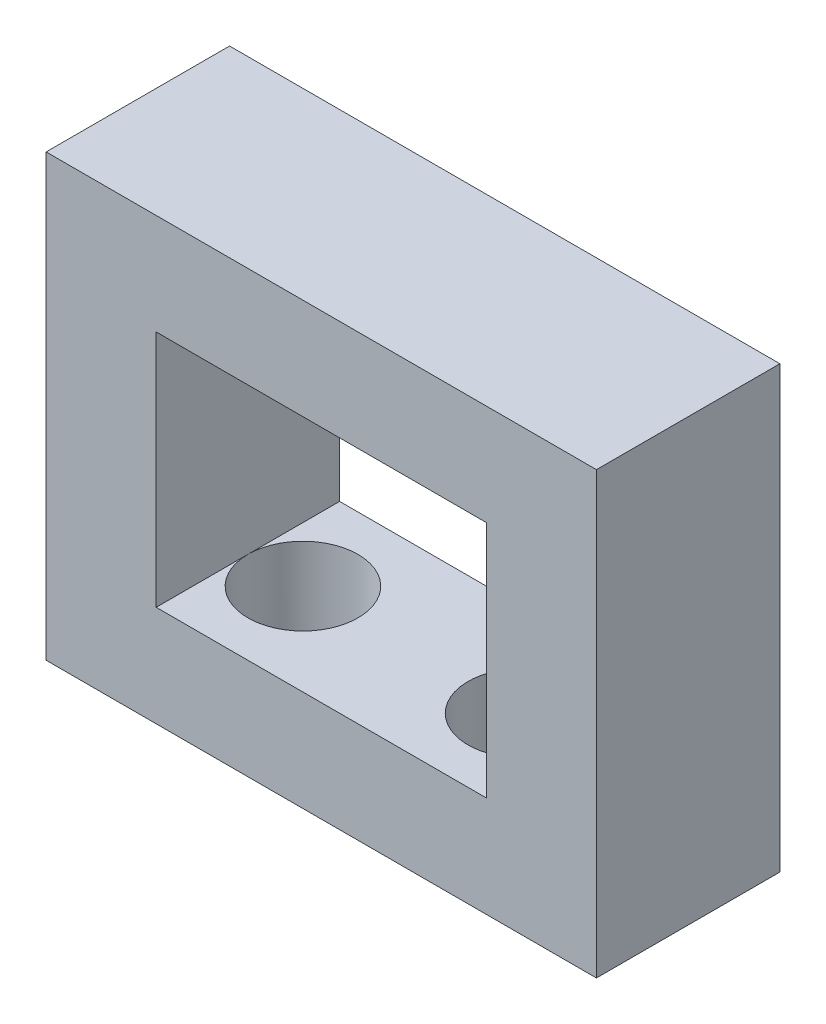
ISO-10303-21;
HEADER;
FILE_DESCRIPTION(('STEP AP214'),'2;1');
FILE_NAME('part.step','',(''),(''),'','','');
FILE_SCHEMA(('AUTOMOTIVE_DESIGN { 1 0 10303 214 1 1 1 1 }'));
ENDSEC;
DATA;
#1=APPLICATION_CONTEXT('core data for automotive mechanical design processes');
#2=APPLICATION_PROTOCOL_DEFINITION('international standard','automotive_design',2000,#1);
#3=PRODUCT_CONTEXT('',#1,'mechanical');
#4=PRODUCT('Part','Part','',(#3));
#5=PRODUCT_RELATED_PRODUCT_CATEGORY('part','',(#4));
#6=PRODUCT_DEFINITION_FORMATION('','',#4);
#7=PRODUCT_DEFINITION_CONTEXT('part definition',#1,'design');
#8=PRODUCT_DEFINITION('design','',#6,#7);
#9=PRODUCT_DEFINITION_SHAPE('','',#8);
#10=(LENGTH_UNIT() NAMED_UNIT(*) SI_UNIT(.MILLI.,.METRE.));
#11=(NAMED_UNIT(*) PLANE_ANGLE_UNIT() SI_UNIT($,.RADIAN.));
#12=(NAMED_UNIT(*) SI_UNIT($,.STERADIAN.) SOLID_ANGLE_UNIT());
#13=UNCERTAINTY_MEASURE_WITH_UNIT(LENGTH_MEASURE(1.E-05),#10,'distance_accuracy_value','');
#14=(GEOMETRIC_REPRESENTATION_CONTEXT(3) GLOBAL_UNCERTAINTY_ASSIGNED_CONTEXT((#13)) GLOBAL_UNIT_ASSIGNED_CONTEXT((#10,
#11,#12)) REPRESENTATION_CONTEXT('',''));
#15=CARTESIAN_POINT('',(0.,0.,0.));
#16=DIRECTION('',(0.,0.,1.));
#17=DIRECTION('',(1.,0.,0.));
#18=AXIS2_PLACEMENT_3D('',#15,#16,#17);
#19=CARTESIAN_POINT('',(7.5,-6.,2.5));
#20=DIRECTION('',(-1.,0.,0.));
#21=DIRECTION('',(0.,0.,1.));
#22=AXIS2_PLACEMENT_3D('',#19,#20,#21);
#23=PLANE('',#22);
#24=DIRECTION('',(0.,1.,0.));
#25=VECTOR('',#24,1.);
#26=CARTESIAN_POINT('',(7.5,-6.,-2.5));
#27=LINE('',#26,#25);
#28=CARTESIAN_POINT('',(7.5,-6.,-2.5));
#29=VERTEX_POINT('',#28);
#30=CARTESIAN_POINT('',(7.5,6.,-2.5));
#31=VERTEX_POINT('',#30);
#32=EDGE_CURVE('E146',#29,#31,#27,.T.);
#33=ORIENTED_EDGE('',*,*,#32,.T.);
#34=DIRECTION('',(0.,0.,-1.));
#35=VECTOR('',#34,1.);
#36=CARTESIAN_POINT('',(7.5,6.,2.5));
#37=LINE('',#36,#35);
#38=CARTESIAN_POINT('',(7.5,6.,2.5));
#39=VERTEX_POINT('',#38);
#40=EDGE_CURVE('E11',#39,#31,#37,.T.);
#41=ORIENTED_EDGE('',*,*,#40,.F.);
#42=DIRECTION('',(0.,1.,0.));
#43=VECTOR('',#42,1.);
#44=CARTESIAN_POINT('',(7.5,-6.,2.5));
#45=LINE('',#44,#43);
#46=CARTESIAN_POINT('',(7.5,-6.,2.5));
#47=VERTEX_POINT('',#46);
#48=EDGE_CURVE('E153',#47,#39,#45,.T.);
#49=ORIENTED_EDGE('',*,*,#48,.F.);
#50=DIRECTION('',(0.,0.,-1.));
#51=VECTOR('',#50,1.);
#52=CARTESIAN_POINT('',(7.5,-6.,2.5));
#53=LINE('',#52,#51);
#54=EDGE_CURVE('E163',#47,#29,#53,.T.);
#55=ORIENTED_EDGE('',*,*,#54,.T.);
#56=EDGE_LOOP('',(#33,#41,#49,#55));
#57=FACE_BOUND('',#56,.T.);
#58=ADVANCED_FACE('F35',(#57),#23,.F.);
#59=CARTESIAN_POINT('',(-7.5,6.,2.5));
#60=DIRECTION('',(0.,-1.,0.));
#61=DIRECTION('',(0.,0.,-1.));
#62=AXIS2_PLACEMENT_3D('',#59,#60,#61);
#63=PLANE('',#62);
#64=DIRECTION('',(-1.,0.,0.));
#65=VECTOR('',#64,1.);
#66=CARTESIAN_POINT('',(-7.5,6.,-2.5));
#67=LINE('',#66,#65);
#68=CARTESIAN_POINT('',(-7.5,6.,-2.5));
#69=VERTEX_POINT('',#68);
#70=EDGE_CURVE('E166',#31,#69,#67,.T.);
#71=ORIENTED_EDGE('',*,*,#70,.T.);
#72=DIRECTION('',(0.,0.,-1.));
#73=VECTOR('',#72,1.);
#74=CARTESIAN_POINT('',(-7.5,6.,2.5));
#75=LINE('',#74,#73);
#76=CARTESIAN_POINT('',(-7.5,6.,2.5));
#77=VERTEX_POINT('',#76);
#78=EDGE_CURVE('E42',#77,#69,#75,.T.);
#79=ORIENTED_EDGE('',*,*,#78,.F.);
#80=DIRECTION('',(-1.,0.,0.));
#81=VECTOR('',#80,1.);
#82=CARTESIAN_POINT('',(-7.5,6.,2.5));
#83=LINE('',#82,#81);
#84=EDGE_CURVE('E156',#39,#77,#83,.T.);
#85=ORIENTED_EDGE('',*,*,#84,.F.);
#86=ORIENTED_EDGE('',*,*,#40,.T.);
#87=EDGE_LOOP('',(#71,#79,#85,#86));
#88=FACE_BOUND('',#87,.T.);
#89=ADVANCED_FACE('F194',(#88),#63,.F.);
#90=CARTESIAN_POINT('',(-7.5,-6.,2.5));
#91=DIRECTION('',(1.,0.,0.));
#92=DIRECTION('',(0.,0.,-1.));
#93=AXIS2_PLACEMENT_3D('',#90,#91,#92);
#94=PLANE('',#93);
#95=DIRECTION('',(0.,-1.,0.));
#96=VECTOR('',#95,1.);
#97=CARTESIAN_POINT('',(-7.5,-6.,-2.5));
#98=LINE('',#97,#96);
#99=CARTESIAN_POINT('',(-7.5,-6.,-2.5));
#100=VERTEX_POINT('',#99);
#101=EDGE_CURVE('E168',#69,#100,#98,.T.);
#102=ORIENTED_EDGE('',*,*,#101,.T.);
#103=DIRECTION('',(0.,0.,-1.));
#104=VECTOR('',#103,1.);
#105=CARTESIAN_POINT('',(-7.5,-6.,2.5));
#106=LINE('',#105,#104);
#107=CARTESIAN_POINT('',(-7.5,-6.,2.5));
#108=VERTEX_POINT('',#107);
#109=EDGE_CURVE('E173',#108,#100,#106,.T.);
#110=ORIENTED_EDGE('',*,*,#109,.F.);
#111=DIRECTION('',(0.,-1.,0.));
#112=VECTOR('',#111,1.);
#113=CARTESIAN_POINT('',(-7.5,-6.,2.5));
#114=LINE('',#113,#112);
#115=EDGE_CURVE('E159',#77,#108,#114,.T.);
#116=ORIENTED_EDGE('',*,*,#115,.F.);
#117=ORIENTED_EDGE('',*,*,#78,.T.);
#118=EDGE_LOOP('',(#102,#110,#116,#117));
#119=FACE_BOUND('',#118,.T.);
#120=ADVANCED_FACE('F180',(#119),#94,.F.);
#121=CARTESIAN_POINT('',(-7.5,-6.,2.5));
#122=DIRECTION('',(0.,1.,0.));
#123=DIRECTION('',(0.,0.,1.));
#124=AXIS2_PLACEMENT_3D('',#121,#122,#123);
#125=PLANE('',#124);
#126=CARTESIAN_POINT('',(-3.,-6.,0.));
#127=DIRECTION('',(0.,-1.,0.));
#128=DIRECTION('',(0.,0.,-1.));
#129=AXIS2_PLACEMENT_3D('',#126,#127,#128);
#130=CIRCLE('',#129,1.5);
#131=CARTESIAN_POINT('',(-3.,-6.,-1.5));
#132=VERTEX_POINT('',#131);
#133=EDGE_CURVE('E233',#132,#132,#130,.T.);
#134=ORIENTED_EDGE('',*,*,#133,.F.);
#135=EDGE_LOOP('',(#134));
#136=FACE_BOUND('',#135,.T.);
#137=CARTESIAN_POINT('',(3.,-6.,0.));
#138=DIRECTION('',(0.,-1.,0.));
#139=DIRECTION('',(0.,0.,-1.));
#140=AXIS2_PLACEMENT_3D('',#137,#138,#139);
#141=CIRCLE('',#140,1.5);
#142=CARTESIAN_POINT('',(3.,-6.,-1.5));
#143=VERTEX_POINT('',#142);
#144=EDGE_CURVE('E236',#143,#143,#141,.T.);
#145=ORIENTED_EDGE('',*,*,#144,.F.);
#146=EDGE_LOOP('',(#145));
#147=FACE_BOUND('',#146,.T.);
#148=DIRECTION('',(1.,0.,0.));
#149=VECTOR('',#148,1.);
#150=CARTESIAN_POINT('',(-7.5,-6.,-2.5));
#151=LINE('',#150,#149);
#152=EDGE_CURVE('E157',#100,#29,#151,.T.);
#153=ORIENTED_EDGE('',*,*,#152,.T.);
#154=ORIENTED_EDGE('',*,*,#54,.F.);
#155=DIRECTION('',(1.,0.,0.));
#156=VECTOR('',#155,1.);
#157=CARTESIAN_POINT('',(-7.5,-6.,2.5));
#158=LINE('',#157,#156);
#159=EDGE_CURVE('E161',#108,#47,#158,.T.);
#160=ORIENTED_EDGE('',*,*,#159,.F.);
#161=ORIENTED_EDGE('',*,*,#109,.T.);
#162=EDGE_LOOP('',(#153,#154,#160,#161));
#163=FACE_BOUND('',#162,.T.);
#164=ADVANCED_FACE('F187',(#136,#147,#163),#125,.F.);
#165=CARTESIAN_POINT('',(0.,0.,2.5));
#166=DIRECTION('',(0.,0.,-1.));
#167=DIRECTION('',(-1.,0.,0.));
#168=AXIS2_PLACEMENT_3D('',#165,#166,#167);
#169=PLANE('',#168);
#170=DIRECTION('',(-1.,0.,0.));
#171=VECTOR('',#170,1.);
#172=CARTESIAN_POINT('',(-4.5,3.25,2.5));
#173=LINE('',#172,#171);
#174=CARTESIAN_POINT('',(4.5,3.25,2.5));
#175=VERTEX_POINT('',#174);
#176=CARTESIAN_POINT('',(-4.5,3.25,2.5));
#177=VERTEX_POINT('',#176);
#178=EDGE_CURVE('E140',#175,#177,#173,.T.);
#179=ORIENTED_EDGE('',*,*,#178,.F.);
#180=DIRECTION('',(0.,1.,0.));
#181=VECTOR('',#180,1.);
#182=CARTESIAN_POINT('',(4.5,-3.25,2.5));
#183=LINE('',#182,#181);
#184=CARTESIAN_POINT('',(4.5,-3.25,2.5));
#185=VERTEX_POINT('',#184);
#186=EDGE_CURVE('E111',#185,#175,#183,.T.);
#187=ORIENTED_EDGE('',*,*,#186,.F.);
#188=DIRECTION('',(1.,0.,0.));
#189=VECTOR('',#188,1.);
#190=CARTESIAN_POINT('',(-4.5,-3.25,2.5));
#191=LINE('',#190,#189);
#192=CARTESIAN_POINT('',(-4.5,-3.25,2.5));
#193=VERTEX_POINT('',#192);
#194=EDGE_CURVE('E129',#193,#185,#191,.T.);
#195=ORIENTED_EDGE('',*,*,#194,.F.);
#196=DIRECTION('',(0.,-1.,0.));
#197=VECTOR('',#196,1.);
#198=CARTESIAN_POINT('',(-4.5,-3.25,2.5));
#199=LINE('',#198,#197);
#200=EDGE_CURVE('E132',#177,#193,#199,.T.);
#201=ORIENTED_EDGE('',*,*,#200,.F.);
#202=EDGE_LOOP('',(#179,#187,#195,#201));
#203=FACE_BOUND('',#202,.T.);
#204=ORIENTED_EDGE('',*,*,#48,.T.);
#205=ORIENTED_EDGE('',*,*,#84,.T.);
#206=ORIENTED_EDGE('',*,*,#115,.T.);
#207=ORIENTED_EDGE('',*,*,#159,.T.);
#208=EDGE_LOOP('',(#204,#205,#206,#207));
#209=FACE_BOUND('',#208,.T.);
#210=ADVANCED_FACE('F193',(#203,#209),#169,.F.);
#211=CARTESIAN_POINT('',(0.,0.,-2.5));
#212=DIRECTION('',(0.,0.,-1.));
#213=DIRECTION('',(-1.,0.,0.));
#214=AXIS2_PLACEMENT_3D('',#211,#212,#213);
#215=PLANE('',#214);
#216=DIRECTION('',(0.,1.,0.));
#217=VECTOR('',#216,1.);
#218=CARTESIAN_POINT('',(4.5,-3.25,-2.5));
#219=LINE('',#218,#217);
#220=CARTESIAN_POINT('',(4.5,-3.25,-2.5));
#221=VERTEX_POINT('',#220);
#222=CARTESIAN_POINT('',(4.5,3.25,-2.5));
#223=VERTEX_POINT('',#222);
#224=EDGE_CURVE('E108',#221,#223,#219,.T.);
#225=ORIENTED_EDGE('',*,*,#224,.T.);
#226=DIRECTION('',(-1.,0.,0.));
#227=VECTOR('',#226,1.);
#228=CARTESIAN_POINT('',(-4.5,3.25,-2.5));
#229=LINE('',#228,#227);
#230=CARTESIAN_POINT('',(-4.5,3.25,-2.5));
#231=VERTEX_POINT('',#230);
#232=EDGE_CURVE('E120',#223,#231,#229,.T.);
#233=ORIENTED_EDGE('',*,*,#232,.T.);
#234=DIRECTION('',(0.,-1.,0.));
#235=VECTOR('',#234,1.);
#236=CARTESIAN_POINT('',(-4.5,-3.25,-2.5));
#237=LINE('',#236,#235);
#238=CARTESIAN_POINT('',(-4.5,-3.25,-2.5));
#239=VERTEX_POINT('',#238);
#240=EDGE_CURVE('E124',#231,#239,#237,.T.);
#241=ORIENTED_EDGE('',*,*,#240,.T.);
#242=DIRECTION('',(1.,0.,0.));
#243=VECTOR('',#242,1.);
#244=CARTESIAN_POINT('',(-4.5,-3.25,-2.5));
#245=LINE('',#244,#243);
#246=EDGE_CURVE('E116',#239,#221,#245,.T.);
#247=ORIENTED_EDGE('',*,*,#246,.T.);
#248=EDGE_LOOP('',(#225,#233,#241,#247));
#249=FACE_BOUND('',#248,.T.);
#250=ORIENTED_EDGE('',*,*,#32,.F.);
#251=ORIENTED_EDGE('',*,*,#152,.F.);
#252=ORIENTED_EDGE('',*,*,#101,.F.);
#253=ORIENTED_EDGE('',*,*,#70,.F.);
#254=EDGE_LOOP('',(#250,#251,#252,#253));
#255=FACE_BOUND('',#254,.T.);
#256=ADVANCED_FACE('F126',(#249,#255),#215,.T.);
#257=CARTESIAN_POINT('',(4.5,-3.25,-2.5));
#258=DIRECTION('',(1.,0.,0.));
#259=DIRECTION('',(0.,0.,-1.));
#260=AXIS2_PLACEMENT_3D('',#257,#258,#259);
#261=PLANE('',#260);
#262=ORIENTED_EDGE('',*,*,#186,.T.);
#263=DIRECTION('',(0.,0.,1.));
#264=VECTOR('',#263,1.);
#265=CARTESIAN_POINT('',(4.5,3.25,-2.5));
#266=LINE('',#265,#264);
#267=EDGE_CURVE('E103',#223,#175,#266,.T.);
#268=ORIENTED_EDGE('',*,*,#267,.F.);
#269=ORIENTED_EDGE('',*,*,#224,.F.);
#270=DIRECTION('',(0.,0.,1.));
#271=VECTOR('',#270,1.);
#272=CARTESIAN_POINT('',(4.5,-3.25,-2.5));
#273=LINE('',#272,#271);
#274=CARTESIAN_POINT('',(4.5,-3.25,0.));
#275=VERTEX_POINT('',#274);
#276=EDGE_CURVE('E144',#221,#275,#273,.T.);
#277=ORIENTED_EDGE('',*,*,#276,.T.);
#278=EDGE_CURVE('E147',#275,#185,#273,.T.);
#279=ORIENTED_EDGE('',*,*,#278,.T.);
#280=EDGE_LOOP('',(#262,#268,#269,#277,#279));
#281=FACE_BOUND('',#280,.T.);
#282=ADVANCED_FACE('F105',(#281),#261,.F.);
#283=CARTESIAN_POINT('',(-4.5,-3.25,-2.5));
#284=DIRECTION('',(0.,-1.,0.));
#285=DIRECTION('',(0.,0.,-1.));
#286=AXIS2_PLACEMENT_3D('',#283,#284,#285);
#287=PLANE('',#286);
#288=DIRECTION('',(0.,0.,1.));
#289=VECTOR('',#288,1.);
#290=CARTESIAN_POINT('',(-4.5,-3.25,-2.5));
#291=LINE('',#290,#289);
#292=CARTESIAN_POINT('',(-4.5,-3.25,0.));
#293=VERTEX_POINT('',#292);
#294=EDGE_CURVE('E148',#239,#293,#291,.T.);
#295=ORIENTED_EDGE('',*,*,#294,.T.);
#296=CARTESIAN_POINT('',(-3.,-3.25,0.));
#297=DIRECTION('',(0.,-1.,0.));
#298=DIRECTION('',(0.,0.,-1.));
#299=AXIS2_PLACEMENT_3D('',#296,#297,#298);
#300=CIRCLE('',#299,1.5);
#301=EDGE_CURVE('E52',#293,#293,#300,.F.);
#302=ORIENTED_EDGE('',*,*,#301,.F.);
#303=EDGE_CURVE('E151',#293,#193,#291,.T.);
#304=ORIENTED_EDGE('',*,*,#303,.T.);
#305=ORIENTED_EDGE('',*,*,#194,.T.);
#306=ORIENTED_EDGE('',*,*,#278,.F.);
#307=CARTESIAN_POINT('',(3.,-3.25,0.));
#308=DIRECTION('',(0.,-1.,0.));
#309=DIRECTION('',(0.,0.,-1.));
#310=AXIS2_PLACEMENT_3D('',#307,#308,#309);
#311=CIRCLE('',#310,1.5);
#312=EDGE_CURVE('E47',#275,#275,#311,.F.);
#313=ORIENTED_EDGE('',*,*,#312,.F.);
#314=ORIENTED_EDGE('',*,*,#276,.F.);
#315=ORIENTED_EDGE('',*,*,#246,.F.);
#316=EDGE_LOOP('',(#295,#302,#304,#305,#306,#313,#314,#315));
#317=FACE_BOUND('',#316,.T.);
#318=ADVANCED_FACE('F212',(#317),#287,.F.);
#319=CARTESIAN_POINT('',(-4.5,-3.25,-2.5));
#320=DIRECTION('',(-1.,0.,0.));
#321=DIRECTION('',(0.,0.,1.));
#322=AXIS2_PLACEMENT_3D('',#319,#320,#321);
#323=PLANE('',#322);
#324=ORIENTED_EDGE('',*,*,#200,.T.);
#325=ORIENTED_EDGE('',*,*,#303,.F.);
#326=ORIENTED_EDGE('',*,*,#294,.F.);
#327=ORIENTED_EDGE('',*,*,#240,.F.);
#328=DIRECTION('',(0.,0.,1.));
#329=VECTOR('',#328,1.);
#330=CARTESIAN_POINT('',(-4.5,3.25,-2.5));
#331=LINE('',#330,#329);
#332=EDGE_CURVE('E115',#231,#177,#331,.T.);
#333=ORIENTED_EDGE('',*,*,#332,.T.);
#334=EDGE_LOOP('',(#324,#325,#326,#327,#333));
#335=FACE_BOUND('',#334,.T.);
#336=ADVANCED_FACE('F216',(#335),#323,.F.);
#337=CARTESIAN_POINT('',(-4.5,3.25,-2.5));
#338=DIRECTION('',(0.,1.,0.));
#339=DIRECTION('',(0.,0.,1.));
#340=AXIS2_PLACEMENT_3D('',#337,#338,#339);
#341=PLANE('',#340);
#342=ORIENTED_EDGE('',*,*,#178,.T.);
#343=ORIENTED_EDGE('',*,*,#332,.F.);
#344=ORIENTED_EDGE('',*,*,#232,.F.);
#345=ORIENTED_EDGE('',*,*,#267,.T.);
#346=EDGE_LOOP('',(#342,#343,#344,#345));
#347=FACE_BOUND('',#346,.T.);
#348=ADVANCED_FACE('F121',(#347),#341,.F.);
#349=CARTESIAN_POINT('',(3.,6.001,0.));
#350=DIRECTION('',(0.,-1.,0.));
#351=DIRECTION('',(0.,0.,-1.));
#352=AXIS2_PLACEMENT_3D('',#349,#350,#351);
#353=CYLINDRICAL_SURFACE('',#352,1.5);
#354=ORIENTED_EDGE('',*,*,#144,.T.);
#355=EDGE_LOOP('',(#354));
#356=FACE_BOUND('',#355,.T.);
#357=ORIENTED_EDGE('',*,*,#312,.T.);
#358=EDGE_LOOP('',(#357));
#359=FACE_BOUND('',#358,.T.);
#360=ADVANCED_FACE('F215',(#356,#359),#353,.F.);
#361=CARTESIAN_POINT('',(-3.,6.001,0.));
#362=DIRECTION('',(0.,-1.,0.));
#363=DIRECTION('',(0.,0.,-1.));
#364=AXIS2_PLACEMENT_3D('',#361,#362,#363);
#365=CYLINDRICAL_SURFACE('',#364,1.5);
#366=ORIENTED_EDGE('',*,*,#133,.T.);
#367=EDGE_LOOP('',(#366));
#368=FACE_BOUND('',#367,.T.);
#369=ORIENTED_EDGE('',*,*,#301,.T.);
#370=EDGE_LOOP('',(#369));
#371=FACE_BOUND('',#370,.T.);
#372=ADVANCED_FACE('F225',(#368,#371),#365,.F.);
#373=CLOSED_SHELL('',(#58,#89,#120,#164,#210,#256,#282,#318,#336,#348,#360,#372));
#374=MANIFOLD_SOLID_BREP('B2',#373);
#375=ADVANCED_BREP_SHAPE_REPRESENTATION('',(#18,#374),#14);
#376=SHAPE_DEFINITION_REPRESENTATION(#9,#375);
ENDSEC;
END-ISO-10303-21;
